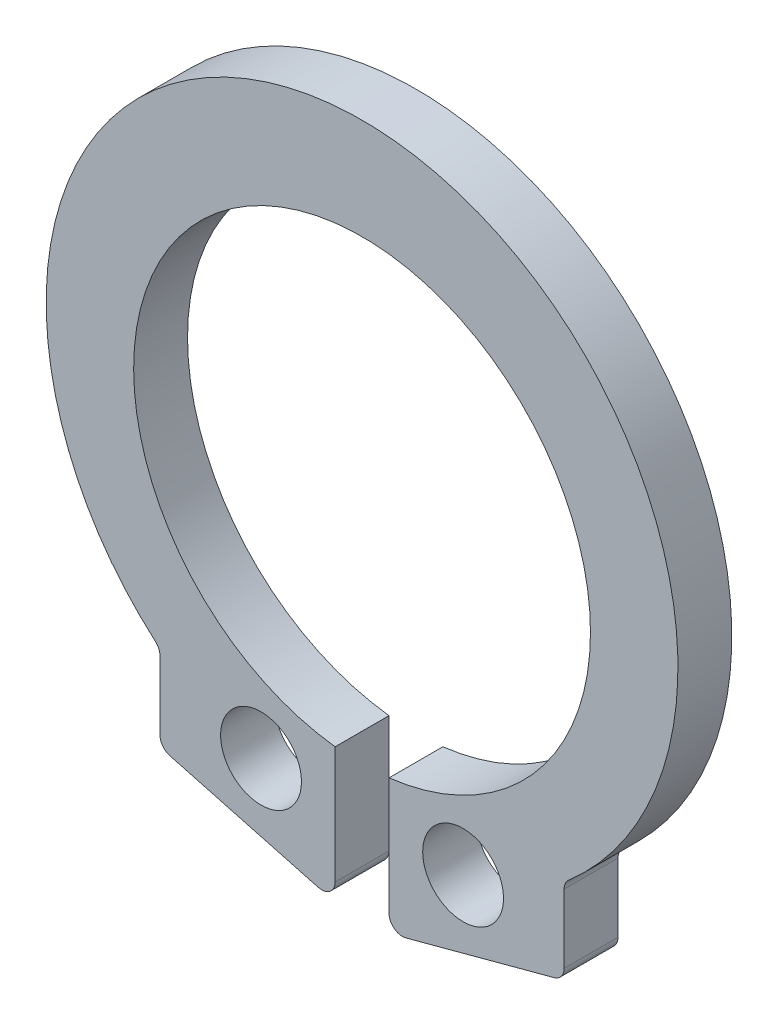
ISO-10303-21;
HEADER;
FILE_DESCRIPTION(('STEP AP214'),'2;1');
FILE_NAME('part.step','',(''),(''),'','','');
FILE_SCHEMA(('AUTOMOTIVE_DESIGN { 1 0 10303 214 1 1 1 1 }'));
ENDSEC;
DATA;
#1=APPLICATION_CONTEXT('core data for automotive mechanical design processes');
#2=APPLICATION_PROTOCOL_DEFINITION('international standard','automotive_design',2000,#1);
#3=PRODUCT_CONTEXT('',#1,'mechanical');
#4=PRODUCT('Part','Part','',(#3));
#5=PRODUCT_RELATED_PRODUCT_CATEGORY('part','',(#4));
#6=PRODUCT_DEFINITION_FORMATION('','',#4);
#7=PRODUCT_DEFINITION_CONTEXT('part definition',#1,'design');
#8=PRODUCT_DEFINITION('design','',#6,#7);
#9=PRODUCT_DEFINITION_SHAPE('','',#8);
#10=(LENGTH_UNIT() NAMED_UNIT(*) SI_UNIT(.MILLI.,.METRE.));
#11=(NAMED_UNIT(*) PLANE_ANGLE_UNIT() SI_UNIT($,.RADIAN.));
#12=(NAMED_UNIT(*) SI_UNIT($,.STERADIAN.) SOLID_ANGLE_UNIT());
#13=UNCERTAINTY_MEASURE_WITH_UNIT(LENGTH_MEASURE(1.E-05),#10,'distance_accuracy_value','');
#14=(GEOMETRIC_REPRESENTATION_CONTEXT(3) GLOBAL_UNCERTAINTY_ASSIGNED_CONTEXT((#13)) GLOBAL_UNIT_ASSIGNED_CONTEXT((#10,
#11,#12)) REPRESENTATION_CONTEXT('',''));
#15=CARTESIAN_POINT('',(0.,0.,0.));
#16=DIRECTION('',(0.,0.,1.));
#17=DIRECTION('',(1.,0.,0.));
#18=AXIS2_PLACEMENT_3D('',#15,#16,#17);
#19=CARTESIAN_POINT('',(0.,-0.200000000000001,0.8));
#20=DIRECTION('',(0.,0.,1.));
#21=DIRECTION('',(1.,0.,0.));
#22=AXIS2_PLACEMENT_3D('',#19,#20,#21);
#23=PLANE('',#22);
#24=CARTESIAN_POINT('',(-1.5,-4.26762995308982,0.8));
#25=DIRECTION('',(0.,0.,1.));
#26=DIRECTION('',(1.,0.,0.));
#27=AXIS2_PLACEMENT_3D('',#24,#25,#26);
#28=CIRCLE('',#27,0.6);
#29=CARTESIAN_POINT('',(-0.899999999999998,-4.26762995308982,0.8));
#30=VERTEX_POINT('',#29);
#31=EDGE_CURVE('E253',#30,#30,#28,.T.);
#32=ORIENTED_EDGE('',*,*,#31,.F.);
#33=EDGE_LOOP('',(#32));
#34=FACE_BOUND('',#33,.T.);
#35=DIRECTION('',(0.96592582628907,0.258819045102514,0.));
#36=VECTOR('',#35,1.);
#37=CARTESIAN_POINT('',(0.400000000000002,-5.56762995308982,0.8));
#38=LINE('',#37,#36);
#39=CARTESIAN_POINT('',(0.651763809020505,-5.50017004377939,0.8));
#40=VERTEX_POINT('',#39);
#41=CARTESIAN_POINT('',(2.8517638090205,-4.91068182043094,0.8));
#42=VERTEX_POINT('',#41);
#43=EDGE_CURVE('E147',#40,#42,#38,.T.);
#44=ORIENTED_EDGE('',*,*,#43,.T.);
#45=CARTESIAN_POINT('',(2.8,-4.71749665517313,0.8));
#46=DIRECTION('',(0.,0.,1.));
#47=DIRECTION('',(1.,0.,0.));
#48=AXIS2_PLACEMENT_3D('',#45,#46,#47);
#49=CIRCLE('',#48,0.2);
#50=CARTESIAN_POINT('',(3.,-4.71749665517313,0.8));
#51=VERTEX_POINT('',#50);
#52=EDGE_CURVE('E195',#42,#51,#49,.T.);
#53=ORIENTED_EDGE('',*,*,#52,.T.);
#54=DIRECTION('',(0.,1.,0.));
#55=VECTOR('',#54,1.);
#56=CARTESIAN_POINT('',(3.,-4.87096205276892,0.8));
#57=LINE('',#56,#55);
#58=CARTESIAN_POINT('',(3.,-3.69758028986525,0.8));
#59=VERTEX_POINT('',#58);
#60=EDGE_CURVE('E246',#51,#59,#57,.T.);
#61=ORIENTED_EDGE('',*,*,#60,.T.);
#62=CARTESIAN_POINT('',(3.2,-3.69758028986525,0.8));
#63=DIRECTION('',(0.,0.,1.));
#64=DIRECTION('',(1.,0.,0.));
#65=AXIS2_PLACEMENT_3D('',#62,#63,#64);
#66=CIRCLE('',#65,0.2);
#67=CARTESIAN_POINT('',(3.06912065439673,-3.54635001216115,0.8));
#68=VERTEX_POINT('',#67);
#69=EDGE_CURVE('E212',#59,#68,#66,.F.);
#70=ORIENTED_EDGE('',*,*,#69,.T.);
#71=CARTESIAN_POINT('',(0.,0.,0.8));
#72=DIRECTION('',(0.,0.,1.));
#73=DIRECTION('',(1.,0.,0.));
#74=AXIS2_PLACEMENT_3D('',#71,#72,#73);
#75=CIRCLE('',#74,4.69);
#76=CARTESIAN_POINT('',(-3.06912065439673,-3.54635001216115,0.8));
#77=VERTEX_POINT('',#76);
#78=EDGE_CURVE('E239',#68,#77,#75,.T.);
#79=ORIENTED_EDGE('',*,*,#78,.T.);
#80=CARTESIAN_POINT('',(-3.2,-3.69758028986525,0.8));
#81=DIRECTION('',(0.,0.,1.));
#82=DIRECTION('',(1.,0.,0.));
#83=AXIS2_PLACEMENT_3D('',#80,#81,#82);
#84=CIRCLE('',#83,0.2);
#85=CARTESIAN_POINT('',(-3.,-3.69758028986525,0.8));
#86=VERTEX_POINT('',#85);
#87=EDGE_CURVE('E11',#77,#86,#84,.F.);
#88=ORIENTED_EDGE('',*,*,#87,.T.);
#89=DIRECTION('',(0.,-1.,0.));
#90=VECTOR('',#89,1.);
#91=CARTESIAN_POINT('',(-3.,-4.87096205276892,0.8));
#92=LINE('',#91,#90);
#93=CARTESIAN_POINT('',(-3.,-4.71749665517312,0.8));
#94=VERTEX_POINT('',#93);
#95=EDGE_CURVE('E237',#86,#94,#92,.T.);
#96=ORIENTED_EDGE('',*,*,#95,.T.);
#97=CARTESIAN_POINT('',(-2.8,-4.71749665517312,0.8));
#98=DIRECTION('',(0.,0.,1.));
#99=DIRECTION('',(1.,0.,0.));
#100=AXIS2_PLACEMENT_3D('',#97,#98,#99);
#101=CIRCLE('',#100,0.2);
#102=CARTESIAN_POINT('',(-2.8517638090205,-4.91068182043094,0.8));
#103=VERTEX_POINT('',#102);
#104=EDGE_CURVE('E193',#94,#103,#101,.T.);
#105=ORIENTED_EDGE('',*,*,#104,.T.);
#106=DIRECTION('',(0.96592582628907,-0.258819045102514,0.));
#107=VECTOR('',#106,1.);
#108=CARTESIAN_POINT('',(-0.399999999999998,-5.56762995308982,0.8));
#109=LINE('',#108,#107);
#110=CARTESIAN_POINT('',(-0.651763809020501,-5.50017004377939,0.8));
#111=VERTEX_POINT('',#110);
#112=EDGE_CURVE('E243',#103,#111,#109,.T.);
#113=ORIENTED_EDGE('',*,*,#112,.T.);
#114=CARTESIAN_POINT('',(-0.599999999999998,-5.30698487852158,0.8));
#115=DIRECTION('',(0.,0.,1.));
#116=DIRECTION('',(1.,0.,0.));
#117=AXIS2_PLACEMENT_3D('',#114,#115,#116);
#118=CIRCLE('',#117,0.2);
#119=CARTESIAN_POINT('',(-0.399999999999998,-5.30698487852158,0.8));
#120=VERTEX_POINT('',#119);
#121=EDGE_CURVE('E50',#111,#120,#118,.T.);
#122=ORIENTED_EDGE('',*,*,#121,.T.);
#123=DIRECTION('',(0.,1.,0.));
#124=VECTOR('',#123,1.);
#125=CARTESIAN_POINT('',(-0.399999999999998,-3.56762995308982,0.8));
#126=LINE('',#125,#124);
#127=CARTESIAN_POINT('',(-0.399999999999998,-3.56762995308982,0.8));
#128=VERTEX_POINT('',#127);
#129=EDGE_CURVE('E153',#120,#128,#126,.T.);
#130=ORIENTED_EDGE('',*,*,#129,.T.);
#131=CARTESIAN_POINT('',(0.,-0.200000000000001,0.8));
#132=DIRECTION('',(0.,0.,-1.));
#133=DIRECTION('',(1.,0.,0.));
#134=AXIS2_PLACEMENT_3D('',#131,#132,#133);
#135=CIRCLE('',#134,3.39130233110345);
#136=CARTESIAN_POINT('',(0.400000000000002,-3.56762995308982,0.8));
#137=VERTEX_POINT('',#136);
#138=EDGE_CURVE('E148',#128,#137,#135,.T.);
#139=ORIENTED_EDGE('',*,*,#138,.T.);
#140=DIRECTION('',(0.,-1.,0.));
#141=VECTOR('',#140,1.);
#142=CARTESIAN_POINT('',(0.400000000000002,-3.56762995308982,0.8));
#143=LINE('',#142,#141);
#144=CARTESIAN_POINT('',(0.400000000000002,-5.30698487852158,0.8));
#145=VERTEX_POINT('',#144);
#146=EDGE_CURVE('E137',#137,#145,#143,.T.);
#147=ORIENTED_EDGE('',*,*,#146,.T.);
#148=CARTESIAN_POINT('',(0.600000000000002,-5.30698487852158,0.8));
#149=DIRECTION('',(0.,0.,1.));
#150=DIRECTION('',(1.,0.,0.));
#151=AXIS2_PLACEMENT_3D('',#148,#149,#150);
#152=CIRCLE('',#151,0.2);
#153=EDGE_CURVE('E190',#145,#40,#152,.T.);
#154=ORIENTED_EDGE('',*,*,#153,.T.);
#155=EDGE_LOOP('',(#44,#53,#61,#70,#79,#88,#96,#105,#113,#122,#130,#139,#147,#154));
#156=FACE_BOUND('',#155,.T.);
#157=CARTESIAN_POINT('',(1.5,-4.26762995308982,0.8));
#158=DIRECTION('',(0.,0.,1.));
#159=DIRECTION('',(-1.,0.,0.));
#160=AXIS2_PLACEMENT_3D('',#157,#158,#159);
#161=CIRCLE('',#160,0.6);
#162=CARTESIAN_POINT('',(0.900000000000002,-4.26762995308982,0.8));
#163=VERTEX_POINT('',#162);
#164=EDGE_CURVE('E280',#163,#163,#161,.T.);
#165=ORIENTED_EDGE('',*,*,#164,.F.);
#166=EDGE_LOOP('',(#165));
#167=FACE_BOUND('',#166,.T.);
#168=ADVANCED_FACE('F35',(#34,#156,#167),#23,.T.);
#169=CARTESIAN_POINT('',(0.,-0.200000000000001,0.));
#170=DIRECTION('',(0.,0.,1.));
#171=DIRECTION('',(1.,0.,0.));
#172=AXIS2_PLACEMENT_3D('',#169,#170,#171);
#173=PLANE('',#172);
#174=DIRECTION('',(0.,1.,0.));
#175=VECTOR('',#174,1.);
#176=CARTESIAN_POINT('',(3.,-4.87096205276892,0.));
#177=LINE('',#176,#175);
#178=CARTESIAN_POINT('',(3.,-4.71749665517313,0.));
#179=VERTEX_POINT('',#178);
#180=CARTESIAN_POINT('',(3.,-3.69758028986525,0.));
#181=VERTEX_POINT('',#180);
#182=EDGE_CURVE('E231',#179,#181,#177,.T.);
#183=ORIENTED_EDGE('',*,*,#182,.F.);
#184=CARTESIAN_POINT('',(2.8,-4.71749665517313,0.));
#185=DIRECTION('',(0.,0.,1.));
#186=DIRECTION('',(1.,0.,0.));
#187=AXIS2_PLACEMENT_3D('',#184,#185,#186);
#188=CIRCLE('',#187,0.2);
#189=CARTESIAN_POINT('',(2.8517638090205,-4.91068182043094,0.));
#190=VERTEX_POINT('',#189);
#191=EDGE_CURVE('E183',#179,#190,#188,.F.);
#192=ORIENTED_EDGE('',*,*,#191,.T.);
#193=DIRECTION('',(0.96592582628907,0.258819045102514,0.));
#194=VECTOR('',#193,1.);
#195=CARTESIAN_POINT('',(0.400000000000002,-5.56762995308982,0.));
#196=LINE('',#195,#194);
#197=CARTESIAN_POINT('',(0.651763809020505,-5.50017004377939,0.));
#198=VERTEX_POINT('',#197);
#199=EDGE_CURVE('E255',#198,#190,#196,.T.);
#200=ORIENTED_EDGE('',*,*,#199,.F.);
#201=CARTESIAN_POINT('',(0.600000000000002,-5.30698487852158,0.));
#202=DIRECTION('',(0.,0.,1.));
#203=DIRECTION('',(1.,0.,0.));
#204=AXIS2_PLACEMENT_3D('',#201,#202,#203);
#205=CIRCLE('',#204,0.2);
#206=CARTESIAN_POINT('',(0.400000000000002,-5.30698487852158,0.));
#207=VERTEX_POINT('',#206);
#208=EDGE_CURVE('E177',#198,#207,#205,.F.);
#209=ORIENTED_EDGE('',*,*,#208,.T.);
#210=DIRECTION('',(0.,-1.,0.));
#211=VECTOR('',#210,1.);
#212=CARTESIAN_POINT('',(0.400000000000002,-3.56762995308982,0.));
#213=LINE('',#212,#211);
#214=CARTESIAN_POINT('',(0.400000000000002,-3.56762995308982,0.));
#215=VERTEX_POINT('',#214);
#216=EDGE_CURVE('E252',#215,#207,#213,.T.);
#217=ORIENTED_EDGE('',*,*,#216,.F.);
#218=CARTESIAN_POINT('',(0.,-0.200000000000001,0.));
#219=DIRECTION('',(0.,0.,-1.));
#220=DIRECTION('',(1.,0.,0.));
#221=AXIS2_PLACEMENT_3D('',#218,#219,#220);
#222=CIRCLE('',#221,3.39130233110345);
#223=CARTESIAN_POINT('',(-0.399999999999998,-3.56762995308982,0.));
#224=VERTEX_POINT('',#223);
#225=EDGE_CURVE('E161',#224,#215,#222,.T.);
#226=ORIENTED_EDGE('',*,*,#225,.F.);
#227=DIRECTION('',(0.,1.,0.));
#228=VECTOR('',#227,1.);
#229=CARTESIAN_POINT('',(-0.399999999999998,-3.56762995308982,0.));
#230=LINE('',#229,#228);
#231=CARTESIAN_POINT('',(-0.399999999999998,-5.30698487852158,0.));
#232=VERTEX_POINT('',#231);
#233=EDGE_CURVE('E157',#232,#224,#230,.T.);
#234=ORIENTED_EDGE('',*,*,#233,.F.);
#235=CARTESIAN_POINT('',(-0.599999999999998,-5.30698487852158,0.));
#236=DIRECTION('',(0.,0.,1.));
#237=DIRECTION('',(1.,0.,0.));
#238=AXIS2_PLACEMENT_3D('',#235,#236,#237);
#239=CIRCLE('',#238,0.2);
#240=CARTESIAN_POINT('',(-0.651763809020501,-5.50017004377939,0.));
#241=VERTEX_POINT('',#240);
#242=EDGE_CURVE('E179',#232,#241,#239,.F.);
#243=ORIENTED_EDGE('',*,*,#242,.T.);
#244=DIRECTION('',(0.96592582628907,-0.258819045102514,0.));
#245=VECTOR('',#244,1.);
#246=CARTESIAN_POINT('',(-0.399999999999998,-5.56762995308982,0.));
#247=LINE('',#246,#245);
#248=CARTESIAN_POINT('',(-2.8517638090205,-4.91068182043094,0.));
#249=VERTEX_POINT('',#248);
#250=EDGE_CURVE('E261',#249,#241,#247,.T.);
#251=ORIENTED_EDGE('',*,*,#250,.F.);
#252=CARTESIAN_POINT('',(-2.8,-4.71749665517312,0.));
#253=DIRECTION('',(0.,0.,1.));
#254=DIRECTION('',(1.,0.,0.));
#255=AXIS2_PLACEMENT_3D('',#252,#253,#254);
#256=CIRCLE('',#255,0.2);
#257=CARTESIAN_POINT('',(-3.,-4.71749665517312,0.));
#258=VERTEX_POINT('',#257);
#259=EDGE_CURVE('E181',#249,#258,#256,.F.);
#260=ORIENTED_EDGE('',*,*,#259,.T.);
#261=DIRECTION('',(0.,-1.,0.));
#262=VECTOR('',#261,1.);
#263=CARTESIAN_POINT('',(-3.,-4.87096205276892,0.));
#264=LINE('',#263,#262);
#265=CARTESIAN_POINT('',(-3.,-3.69758028986525,0.));
#266=VERTEX_POINT('',#265);
#267=EDGE_CURVE('E222',#266,#258,#264,.T.);
#268=ORIENTED_EDGE('',*,*,#267,.F.);
#269=CARTESIAN_POINT('',(-3.2,-3.69758028986525,0.));
#270=DIRECTION('',(0.,0.,1.));
#271=DIRECTION('',(1.,0.,0.));
#272=AXIS2_PLACEMENT_3D('',#269,#270,#271);
#273=CIRCLE('',#272,0.2);
#274=CARTESIAN_POINT('',(-3.06912065439673,-3.54635001216115,0.));
#275=VERTEX_POINT('',#274);
#276=EDGE_CURVE('E43',#266,#275,#273,.T.);
#277=ORIENTED_EDGE('',*,*,#276,.T.);
#278=CARTESIAN_POINT('',(0.,0.,0.));
#279=DIRECTION('',(0.,0.,1.));
#280=DIRECTION('',(1.,0.,0.));
#281=AXIS2_PLACEMENT_3D('',#278,#279,#280);
#282=CIRCLE('',#281,4.69);
#283=CARTESIAN_POINT('',(3.06912065439673,-3.54635001216115,0.));
#284=VERTEX_POINT('',#283);
#285=EDGE_CURVE('E220',#284,#275,#282,.T.);
#286=ORIENTED_EDGE('',*,*,#285,.F.);
#287=CARTESIAN_POINT('',(3.2,-3.69758028986525,0.));
#288=DIRECTION('',(0.,0.,1.));
#289=DIRECTION('',(1.,0.,0.));
#290=AXIS2_PLACEMENT_3D('',#287,#288,#289);
#291=CIRCLE('',#290,0.2);
#292=EDGE_CURVE('E210',#284,#181,#291,.T.);
#293=ORIENTED_EDGE('',*,*,#292,.T.);
#294=EDGE_LOOP('',(#183,#192,#200,#209,#217,#226,#234,#243,#251,#260,#268,#277,#286,#293));
#295=FACE_BOUND('',#294,.T.);
#296=CARTESIAN_POINT('',(-1.5,-4.26762995308982,0.));
#297=DIRECTION('',(0.,0.,1.));
#298=DIRECTION('',(1.,0.,0.));
#299=AXIS2_PLACEMENT_3D('',#296,#297,#298);
#300=CIRCLE('',#299,0.6);
#301=CARTESIAN_POINT('',(-0.899999999999998,-4.26762995308982,0.));
#302=VERTEX_POINT('',#301);
#303=EDGE_CURVE('E277',#302,#302,#300,.T.);
#304=ORIENTED_EDGE('',*,*,#303,.T.);
#305=EDGE_LOOP('',(#304));
#306=FACE_BOUND('',#305,.T.);
#307=CARTESIAN_POINT('',(1.5,-4.26762995308982,0.));
#308=DIRECTION('',(0.,0.,1.));
#309=DIRECTION('',(-1.,0.,0.));
#310=AXIS2_PLACEMENT_3D('',#307,#308,#309);
#311=CIRCLE('',#310,0.6);
#312=CARTESIAN_POINT('',(0.900000000000002,-4.26762995308982,0.));
#313=VERTEX_POINT('',#312);
#314=EDGE_CURVE('E283',#313,#313,#311,.T.);
#315=ORIENTED_EDGE('',*,*,#314,.T.);
#316=EDGE_LOOP('',(#315));
#317=FACE_BOUND('',#316,.T.);
#318=ADVANCED_FACE('F218',(#295,#306,#317),#173,.F.);
#319=CARTESIAN_POINT('',(0.,-0.200000000000001,0.8));
#320=DIRECTION('',(0.,0.,-1.));
#321=DIRECTION('',(-1.,0.,0.));
#322=AXIS2_PLACEMENT_3D('',#319,#320,#321);
#323=CYLINDRICAL_SURFACE('',#322,3.39130233110345);
#324=ORIENTED_EDGE('',*,*,#225,.T.);
#325=DIRECTION('',(0.,0.,-1.));
#326=VECTOR('',#325,1.);
#327=CARTESIAN_POINT('',(0.400000000000002,-3.56762995308982,0.8));
#328=LINE('',#327,#326);
#329=EDGE_CURVE('E142',#137,#215,#328,.T.);
#330=ORIENTED_EDGE('',*,*,#329,.F.);
#331=ORIENTED_EDGE('',*,*,#138,.F.);
#332=DIRECTION('',(0.,0.,-1.));
#333=VECTOR('',#332,1.);
#334=CARTESIAN_POINT('',(-0.399999999999998,-3.56762995308982,0.8));
#335=LINE('',#334,#333);
#336=EDGE_CURVE('E163',#128,#224,#335,.T.);
#337=ORIENTED_EDGE('',*,*,#336,.T.);
#338=EDGE_LOOP('',(#324,#330,#331,#337));
#339=FACE_BOUND('',#338,.T.);
#340=ADVANCED_FACE('F159',(#339),#323,.F.);
#341=CARTESIAN_POINT('',(0.400000000000002,-3.56762995308982,0.8));
#342=DIRECTION('',(1.,0.,0.));
#343=DIRECTION('',(0.,1.,0.));
#344=AXIS2_PLACEMENT_3D('',#341,#342,#343);
#345=PLANE('',#344);
#346=ORIENTED_EDGE('',*,*,#216,.T.);
#347=DIRECTION('',(0.,0.,-1.));
#348=VECTOR('',#347,1.);
#349=CARTESIAN_POINT('',(0.400000000000002,-5.30698487852158,0.8));
#350=LINE('',#349,#348);
#351=EDGE_CURVE('E145',#207,#145,#350,.F.);
#352=ORIENTED_EDGE('',*,*,#351,.T.);
#353=ORIENTED_EDGE('',*,*,#146,.F.);
#354=ORIENTED_EDGE('',*,*,#329,.T.);
#355=EDGE_LOOP('',(#346,#352,#353,#354));
#356=FACE_BOUND('',#355,.T.);
#357=ADVANCED_FACE('F140',(#356),#345,.F.);
#358=CARTESIAN_POINT('',(0.400000000000002,-5.56762995308982,0.8));
#359=DIRECTION('',(-0.258819045102514,0.96592582628907,0.));
#360=DIRECTION('',(-0.96592582628907,-0.258819045102514,0.));
#361=AXIS2_PLACEMENT_3D('',#358,#359,#360);
#362=PLANE('',#361);
#363=ORIENTED_EDGE('',*,*,#199,.T.);
#364=DIRECTION('',(0.,0.,-1.));
#365=VECTOR('',#364,1.);
#366=CARTESIAN_POINT('',(2.8517638090205,-4.91068182043094,0.8));
#367=LINE('',#366,#365);
#368=EDGE_CURVE('E188',#190,#42,#367,.F.);
#369=ORIENTED_EDGE('',*,*,#368,.T.);
#370=ORIENTED_EDGE('',*,*,#43,.F.);
#371=DIRECTION('',(0.,0.,-1.));
#372=VECTOR('',#371,1.);
#373=CARTESIAN_POINT('',(0.651763809020505,-5.50017004377939,0.8));
#374=LINE('',#373,#372);
#375=EDGE_CURVE('E185',#40,#198,#374,.T.);
#376=ORIENTED_EDGE('',*,*,#375,.T.);
#377=EDGE_LOOP('',(#363,#369,#370,#376));
#378=FACE_BOUND('',#377,.T.);
#379=ADVANCED_FACE('F272',(#378),#362,.F.);
#380=CARTESIAN_POINT('',(3.,-4.87096205276892,0.8));
#381=DIRECTION('',(-1.,0.,0.));
#382=DIRECTION('',(0.,0.,1.));
#383=AXIS2_PLACEMENT_3D('',#380,#381,#382);
#384=PLANE('',#383);
#385=ORIENTED_EDGE('',*,*,#182,.T.);
#386=DIRECTION('',(0.,0.,1.));
#387=VECTOR('',#386,1.);
#388=CARTESIAN_POINT('',(3.,-3.69758028986525,0.8));
#389=LINE('',#388,#387);
#390=EDGE_CURVE('E175',#181,#59,#389,.T.);
#391=ORIENTED_EDGE('',*,*,#390,.T.);
#392=ORIENTED_EDGE('',*,*,#60,.F.);
#393=DIRECTION('',(0.,0.,-1.));
#394=VECTOR('',#393,1.);
#395=CARTESIAN_POINT('',(3.,-4.71749665517313,0.8));
#396=LINE('',#395,#394);
#397=EDGE_CURVE('E172',#51,#179,#396,.T.);
#398=ORIENTED_EDGE('',*,*,#397,.T.);
#399=EDGE_LOOP('',(#385,#391,#392,#398));
#400=FACE_BOUND('',#399,.T.);
#401=ADVANCED_FACE('F312',(#400),#384,.F.);
#402=CARTESIAN_POINT('',(0.,0.,0.8));
#403=DIRECTION('',(0.,0.,-1.));
#404=DIRECTION('',(-1.,0.,0.));
#405=AXIS2_PLACEMENT_3D('',#402,#403,#404);
#406=CYLINDRICAL_SURFACE('',#405,4.69);
#407=ORIENTED_EDGE('',*,*,#78,.F.);
#408=DIRECTION('',(0.,0.,-1.));
#409=VECTOR('',#408,1.);
#410=CARTESIAN_POINT('',(3.06912065439673,-3.54635001216115,0.8));
#411=LINE('',#410,#409);
#412=EDGE_CURVE('E165',#68,#284,#411,.T.);
#413=ORIENTED_EDGE('',*,*,#412,.T.);
#414=ORIENTED_EDGE('',*,*,#285,.T.);
#415=DIRECTION('',(0.,0.,-1.));
#416=VECTOR('',#415,1.);
#417=CARTESIAN_POINT('',(-3.06912065439673,-3.54635001216115,0.8));
#418=LINE('',#417,#416);
#419=EDGE_CURVE('E162',#275,#77,#418,.F.);
#420=ORIENTED_EDGE('',*,*,#419,.T.);
#421=EDGE_LOOP('',(#407,#413,#414,#420));
#422=FACE_BOUND('',#421,.T.);
#423=ADVANCED_FACE('F228',(#422),#406,.T.);
#424=CARTESIAN_POINT('',(-3.,-4.87096205276892,0.8));
#425=DIRECTION('',(1.,0.,0.));
#426=DIRECTION('',(0.,0.,-1.));
#427=AXIS2_PLACEMENT_3D('',#424,#425,#426);
#428=PLANE('',#427);
#429=ORIENTED_EDGE('',*,*,#95,.F.);
#430=DIRECTION('',(0.,0.,1.));
#431=VECTOR('',#430,1.);
#432=CARTESIAN_POINT('',(-3.,-3.69758028986525,0.));
#433=LINE('',#432,#431);
#434=EDGE_CURVE('E199',#86,#266,#433,.F.);
#435=ORIENTED_EDGE('',*,*,#434,.T.);
#436=ORIENTED_EDGE('',*,*,#267,.T.);
#437=DIRECTION('',(0.,0.,-1.));
#438=VECTOR('',#437,1.);
#439=CARTESIAN_POINT('',(-3.,-4.71749665517312,0.8));
#440=LINE('',#439,#438);
#441=EDGE_CURVE('E197',#258,#94,#440,.F.);
#442=ORIENTED_EDGE('',*,*,#441,.T.);
#443=EDGE_LOOP('',(#429,#435,#436,#442));
#444=FACE_BOUND('',#443,.T.);
#445=ADVANCED_FACE('F241',(#444),#428,.F.);
#446=CARTESIAN_POINT('',(-0.399999999999998,-5.56762995308982,0.8));
#447=DIRECTION('',(0.258819045102514,0.96592582628907,0.));
#448=DIRECTION('',(-0.96592582628907,0.258819045102514,0.));
#449=AXIS2_PLACEMENT_3D('',#446,#447,#448);
#450=PLANE('',#449);
#451=ORIENTED_EDGE('',*,*,#112,.F.);
#452=DIRECTION('',(0.,0.,-1.));
#453=VECTOR('',#452,1.);
#454=CARTESIAN_POINT('',(-2.8517638090205,-4.91068182043094,0.8));
#455=LINE('',#454,#453);
#456=EDGE_CURVE('E203',#103,#249,#455,.T.);
#457=ORIENTED_EDGE('',*,*,#456,.T.);
#458=ORIENTED_EDGE('',*,*,#250,.T.);
#459=DIRECTION('',(0.,0.,-1.));
#460=VECTOR('',#459,1.);
#461=CARTESIAN_POINT('',(-0.651763809020501,-5.50017004377939,0.8));
#462=LINE('',#461,#460);
#463=EDGE_CURVE('E58',#241,#111,#462,.F.);
#464=ORIENTED_EDGE('',*,*,#463,.T.);
#465=EDGE_LOOP('',(#451,#457,#458,#464));
#466=FACE_BOUND('',#465,.T.);
#467=ADVANCED_FACE('F305',(#466),#450,.F.);
#468=CARTESIAN_POINT('',(-0.399999999999998,-3.56762995308982,0.8));
#469=DIRECTION('',(-1.,0.,0.));
#470=DIRECTION('',(0.,-1.,0.));
#471=AXIS2_PLACEMENT_3D('',#468,#469,#470);
#472=PLANE('',#471);
#473=ORIENTED_EDGE('',*,*,#129,.F.);
#474=DIRECTION('',(0.,0.,-1.));
#475=VECTOR('',#474,1.);
#476=CARTESIAN_POINT('',(-0.399999999999998,-5.30698487852158,0.8));
#477=LINE('',#476,#475);
#478=EDGE_CURVE('E206',#120,#232,#477,.T.);
#479=ORIENTED_EDGE('',*,*,#478,.T.);
#480=ORIENTED_EDGE('',*,*,#233,.T.);
#481=ORIENTED_EDGE('',*,*,#336,.F.);
#482=EDGE_LOOP('',(#473,#479,#480,#481));
#483=FACE_BOUND('',#482,.T.);
#484=ADVANCED_FACE('F264',(#483),#472,.F.);
#485=CARTESIAN_POINT('',(-1.5,-4.26762995308982,0.8));
#486=DIRECTION('',(0.,0.,-1.));
#487=DIRECTION('',(-1.,0.,0.));
#488=AXIS2_PLACEMENT_3D('',#485,#486,#487);
#489=CYLINDRICAL_SURFACE('',#488,0.6);
#490=ORIENTED_EDGE('',*,*,#31,.T.);
#491=EDGE_LOOP('',(#490));
#492=FACE_BOUND('',#491,.T.);
#493=ORIENTED_EDGE('',*,*,#303,.F.);
#494=EDGE_LOOP('',(#493));
#495=FACE_BOUND('',#494,.T.);
#496=ADVANCED_FACE('F300',(#492,#495),#489,.F.);
#497=CARTESIAN_POINT('',(1.5,-4.26762995308982,0.8));
#498=DIRECTION('',(0.,0.,-1.));
#499=DIRECTION('',(-1.,0.,0.));
#500=AXIS2_PLACEMENT_3D('',#497,#498,#499);
#501=CYLINDRICAL_SURFACE('',#500,0.6);
#502=ORIENTED_EDGE('',*,*,#164,.T.);
#503=EDGE_LOOP('',(#502));
#504=FACE_BOUND('',#503,.T.);
#505=ORIENTED_EDGE('',*,*,#314,.F.);
#506=EDGE_LOOP('',(#505));
#507=FACE_BOUND('',#506,.T.);
#508=ADVANCED_FACE('F289',(#504,#507),#501,.F.);
#509=CARTESIAN_POINT('',(3.2,-3.69758028986525,0.8));
#510=DIRECTION('',(0.,0.,-1.));
#511=DIRECTION('',(-1.,0.,0.));
#512=AXIS2_PLACEMENT_3D('',#509,#510,#511);
#513=CYLINDRICAL_SURFACE('',#512,0.2);
#514=ORIENTED_EDGE('',*,*,#69,.F.);
#515=ORIENTED_EDGE('',*,*,#390,.F.);
#516=ORIENTED_EDGE('',*,*,#292,.F.);
#517=ORIENTED_EDGE('',*,*,#412,.F.);
#518=EDGE_LOOP('',(#514,#515,#516,#517));
#519=FACE_BOUND('',#518,.T.);
#520=ADVANCED_FACE('F322',(#519),#513,.F.);
#521=CARTESIAN_POINT('',(2.8,-4.71749665517313,0.8));
#522=DIRECTION('',(0.,0.,-1.));
#523=DIRECTION('',(-1.,0.,0.));
#524=AXIS2_PLACEMENT_3D('',#521,#522,#523);
#525=CYLINDRICAL_SURFACE('',#524,0.2);
#526=ORIENTED_EDGE('',*,*,#52,.F.);
#527=ORIENTED_EDGE('',*,*,#368,.F.);
#528=ORIENTED_EDGE('',*,*,#191,.F.);
#529=ORIENTED_EDGE('',*,*,#397,.F.);
#530=EDGE_LOOP('',(#526,#527,#528,#529));
#531=FACE_BOUND('',#530,.T.);
#532=ADVANCED_FACE('F325',(#531),#525,.T.);
#533=CARTESIAN_POINT('',(-3.2,-3.69758028986525,0.8));
#534=DIRECTION('',(0.,0.,-1.));
#535=DIRECTION('',(-1.,0.,0.));
#536=AXIS2_PLACEMENT_3D('',#533,#534,#535);
#537=CYLINDRICAL_SURFACE('',#536,0.2);
#538=ORIENTED_EDGE('',*,*,#87,.F.);
#539=ORIENTED_EDGE('',*,*,#419,.F.);
#540=ORIENTED_EDGE('',*,*,#276,.F.);
#541=ORIENTED_EDGE('',*,*,#434,.F.);
#542=EDGE_LOOP('',(#538,#539,#540,#541));
#543=FACE_BOUND('',#542,.T.);
#544=ADVANCED_FACE('F234',(#543),#537,.F.);
#545=CARTESIAN_POINT('',(-2.8,-4.71749665517312,0.8));
#546=DIRECTION('',(0.,0.,-1.));
#547=DIRECTION('',(-1.,0.,0.));
#548=AXIS2_PLACEMENT_3D('',#545,#546,#547);
#549=CYLINDRICAL_SURFACE('',#548,0.2);
#550=ORIENTED_EDGE('',*,*,#104,.F.);
#551=ORIENTED_EDGE('',*,*,#441,.F.);
#552=ORIENTED_EDGE('',*,*,#259,.F.);
#553=ORIENTED_EDGE('',*,*,#456,.F.);
#554=EDGE_LOOP('',(#550,#551,#552,#553));
#555=FACE_BOUND('',#554,.T.);
#556=ADVANCED_FACE('F332',(#555),#549,.T.);
#557=CARTESIAN_POINT('',(-0.599999999999998,-5.30698487852158,0.8));
#558=DIRECTION('',(0.,0.,-1.));
#559=DIRECTION('',(-1.,0.,0.));
#560=AXIS2_PLACEMENT_3D('',#557,#558,#559);
#561=CYLINDRICAL_SURFACE('',#560,0.2);
#562=ORIENTED_EDGE('',*,*,#121,.F.);
#563=ORIENTED_EDGE('',*,*,#463,.F.);
#564=ORIENTED_EDGE('',*,*,#242,.F.);
#565=ORIENTED_EDGE('',*,*,#478,.F.);
#566=EDGE_LOOP('',(#562,#563,#564,#565));
#567=FACE_BOUND('',#566,.T.);
#568=ADVANCED_FACE('F334',(#567),#561,.T.);
#569=CARTESIAN_POINT('',(0.600000000000002,-5.30698487852158,0.8));
#570=DIRECTION('',(0.,0.,-1.));
#571=DIRECTION('',(-1.,0.,0.));
#572=AXIS2_PLACEMENT_3D('',#569,#570,#571);
#573=CYLINDRICAL_SURFACE('',#572,0.2);
#574=ORIENTED_EDGE('',*,*,#153,.F.);
#575=ORIENTED_EDGE('',*,*,#351,.F.);
#576=ORIENTED_EDGE('',*,*,#208,.F.);
#577=ORIENTED_EDGE('',*,*,#375,.F.);
#578=EDGE_LOOP('',(#574,#575,#576,#577));
#579=FACE_BOUND('',#578,.T.);
#580=ADVANCED_FACE('F37',(#579),#573,.T.);
#581=CLOSED_SHELL('',(#168,#318,#340,#357,#379,#401,#423,#445,#467,#484,#496,#508,#520,#532,
#544,#556,#568,#580));
#582=MANIFOLD_SOLID_BREP('B2',#581);
#583=ADVANCED_BREP_SHAPE_REPRESENTATION('',(#18,#582),#14);
#584=SHAPE_DEFINITION_REPRESENTATION(#9,#583);
ENDSEC;
END-ISO-10303-21;
